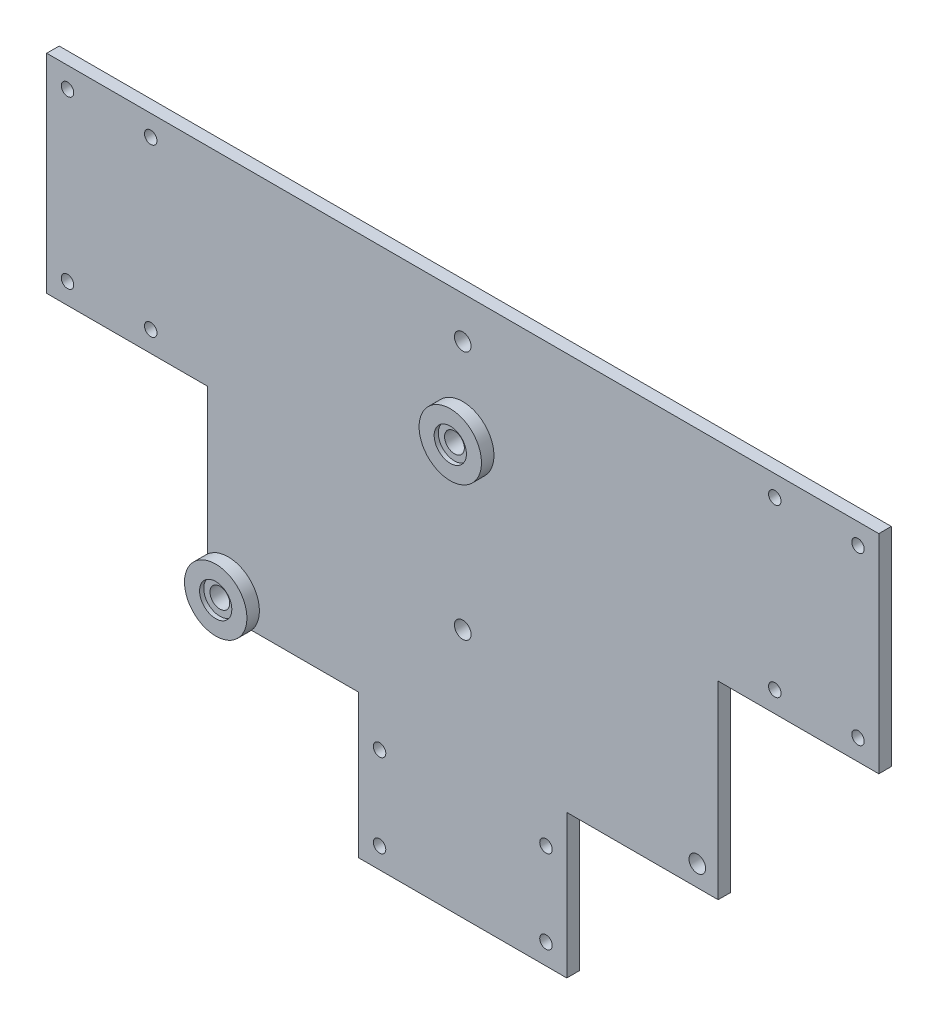
ISO-10303-21;
HEADER;
FILE_DESCRIPTION(('STEP AP214'),'2;1');
FILE_NAME('part.step','',(''),(''),'','','');
FILE_SCHEMA(('AUTOMOTIVE_DESIGN { 1 0 10303 214 1 1 1 1 }'));
ENDSEC;
DATA;
#1=APPLICATION_CONTEXT('core data for automotive mechanical design processes');
#2=APPLICATION_PROTOCOL_DEFINITION('international standard','automotive_design',2000,#1);
#3=PRODUCT_CONTEXT('',#1,'mechanical');
#4=PRODUCT('Part','Part','',(#3));
#5=PRODUCT_RELATED_PRODUCT_CATEGORY('part','',(#4));
#6=PRODUCT_DEFINITION_FORMATION('','',#4);
#7=PRODUCT_DEFINITION_CONTEXT('part definition',#1,'design');
#8=PRODUCT_DEFINITION('design','',#6,#7);
#9=PRODUCT_DEFINITION_SHAPE('','',#8);
#10=(LENGTH_UNIT() NAMED_UNIT(*) SI_UNIT(.MILLI.,.METRE.));
#11=(NAMED_UNIT(*) PLANE_ANGLE_UNIT() SI_UNIT($,.RADIAN.));
#12=(NAMED_UNIT(*) SI_UNIT($,.STERADIAN.) SOLID_ANGLE_UNIT());
#13=UNCERTAINTY_MEASURE_WITH_UNIT(LENGTH_MEASURE(1.E-05),#10,'distance_accuracy_value','');
#14=(GEOMETRIC_REPRESENTATION_CONTEXT(3) GLOBAL_UNCERTAINTY_ASSIGNED_CONTEXT((#13)) GLOBAL_UNIT_ASSIGNED_CONTEXT((#10,
#11,#12)) REPRESENTATION_CONTEXT('',''));
#15=CARTESIAN_POINT('',(0.,0.,0.));
#16=DIRECTION('',(0.,0.,1.));
#17=DIRECTION('',(1.,0.,0.));
#18=AXIS2_PLACEMENT_3D('',#15,#16,#17);
#19=CARTESIAN_POINT('',(100.,50.,3.));
#20=DIRECTION('',(0.,0.,-1.));
#21=DIRECTION('',(-1.,0.,0.));
#22=AXIS2_PLACEMENT_3D('',#19,#20,#21);
#23=PLANE('',#22);
#24=CARTESIAN_POINT('',(0.,20.,3.));
#25=DIRECTION('',(0.,0.,-1.));
#26=DIRECTION('',(-1.,0.,0.));
#27=AXIS2_PLACEMENT_3D('',#24,#25,#26);
#28=CIRCLE('',#27,7.5);
#29=CARTESIAN_POINT('',(-7.50000000000001,20.,3.));
#30=VERTEX_POINT('',#29);
#31=EDGE_CURVE('E145',#30,#30,#28,.T.);
#32=ORIENTED_EDGE('',*,*,#31,.T.);
#33=EDGE_LOOP('',(#32));
#34=FACE_BOUND('',#33,.T.);
#35=CARTESIAN_POINT('',(56.3815572471545,-40.5212085995402,3.));
#36=DIRECTION('',(0.,0.,1.));
#37=DIRECTION('',(-1.,0.,0.));
#38=AXIS2_PLACEMENT_3D('',#35,#36,#37);
#39=CIRCLE('',#38,2.00000000000002);
#40=CARTESIAN_POINT('',(54.3815572471545,-40.5212085995402,3.));
#41=VERTEX_POINT('',#40);
#42=EDGE_CURVE('E157',#41,#41,#39,.T.);
#43=ORIENTED_EDGE('',*,*,#42,.F.);
#44=EDGE_LOOP('',(#43));
#45=FACE_BOUND('',#44,.T.);
#46=CARTESIAN_POINT('',(75.,45.,3.));
#47=DIRECTION('',(0.,0.,1.));
#48=DIRECTION('',(1.,0.,0.));
#49=AXIS2_PLACEMENT_3D('',#46,#47,#48);
#50=CIRCLE('',#49,1.50000000000001);
#51=CARTESIAN_POINT('',(76.5,45.,3.));
#52=VERTEX_POINT('',#51);
#53=EDGE_CURVE('E169',#52,#52,#50,.T.);
#54=ORIENTED_EDGE('',*,*,#53,.F.);
#55=EDGE_LOOP('',(#54));
#56=FACE_BOUND('',#55,.T.);
#57=CARTESIAN_POINT('',(75.,5.,3.));
#58=DIRECTION('',(0.,0.,1.));
#59=DIRECTION('',(-1.,0.,0.));
#60=AXIS2_PLACEMENT_3D('',#57,#58,#59);
#61=CIRCLE('',#60,1.50000000000001);
#62=CARTESIAN_POINT('',(73.5,5.,3.));
#63=VERTEX_POINT('',#62);
#64=EDGE_CURVE('E181',#63,#63,#61,.T.);
#65=ORIENTED_EDGE('',*,*,#64,.F.);
#66=EDGE_LOOP('',(#65));
#67=FACE_BOUND('',#66,.T.);
#68=CARTESIAN_POINT('',(-75.,5.,3.));
#69=DIRECTION('',(0.,0.,1.));
#70=DIRECTION('',(1.,0.,0.));
#71=AXIS2_PLACEMENT_3D('',#68,#69,#70);
#72=CIRCLE('',#71,1.5);
#73=CARTESIAN_POINT('',(-73.5,5.,3.));
#74=VERTEX_POINT('',#73);
#75=EDGE_CURVE('E193',#74,#74,#72,.T.);
#76=ORIENTED_EDGE('',*,*,#75,.F.);
#77=EDGE_LOOP('',(#76));
#78=FACE_BOUND('',#77,.T.);
#79=CARTESIAN_POINT('',(-95.,45.,3.));
#80=DIRECTION('',(0.,0.,1.));
#81=DIRECTION('',(1.,0.,0.));
#82=AXIS2_PLACEMENT_3D('',#79,#80,#81);
#83=CIRCLE('',#82,1.5);
#84=CARTESIAN_POINT('',(-93.5,45.,3.));
#85=VERTEX_POINT('',#84);
#86=EDGE_CURVE('E205',#85,#85,#83,.T.);
#87=ORIENTED_EDGE('',*,*,#86,.F.);
#88=EDGE_LOOP('',(#87));
#89=FACE_BOUND('',#88,.T.);
#90=CARTESIAN_POINT('',(20.,-75.,3.));
#91=DIRECTION('',(0.,0.,1.));
#92=DIRECTION('',(1.,0.,0.));
#93=AXIS2_PLACEMENT_3D('',#90,#91,#92);
#94=CIRCLE('',#93,1.5);
#95=CARTESIAN_POINT('',(21.5,-75.,3.));
#96=VERTEX_POINT('',#95);
#97=EDGE_CURVE('E217',#96,#96,#94,.T.);
#98=ORIENTED_EDGE('',*,*,#97,.F.);
#99=EDGE_LOOP('',(#98));
#100=FACE_BOUND('',#99,.T.);
#101=CARTESIAN_POINT('',(-20.,-55.,3.));
#102=DIRECTION('',(0.,0.,1.));
#103=DIRECTION('',(1.,0.,0.));
#104=AXIS2_PLACEMENT_3D('',#101,#102,#103);
#105=CIRCLE('',#104,1.5);
#106=CARTESIAN_POINT('',(-18.5,-55.,3.));
#107=VERTEX_POINT('',#106);
#108=EDGE_CURVE('E229',#107,#107,#105,.T.);
#109=ORIENTED_EDGE('',*,*,#108,.F.);
#110=EDGE_LOOP('',(#109));
#111=FACE_BOUND('',#110,.T.);
#112=CARTESIAN_POINT('',(0.,-20.,3.));
#113=DIRECTION('',(0.,0.,1.));
#114=DIRECTION('',(1.,0.,0.));
#115=AXIS2_PLACEMENT_3D('',#112,#113,#114);
#116=CIRCLE('',#115,2.);
#117=CARTESIAN_POINT('',(2.,-20.,3.));
#118=VERTEX_POINT('',#117);
#119=EDGE_CURVE('E241',#118,#118,#116,.T.);
#120=ORIENTED_EDGE('',*,*,#119,.F.);
#121=EDGE_LOOP('',(#120));
#122=FACE_BOUND('',#121,.T.);
#123=DIRECTION('',(0.,-1.,0.));
#124=VECTOR('',#123,1.);
#125=CARTESIAN_POINT('',(-61.3815572471545,0.,3.));
#126=LINE('',#125,#124);
#127=CARTESIAN_POINT('',(-61.3815572471545,0.,3.));
#128=VERTEX_POINT('',#127);
#129=CARTESIAN_POINT('',(-61.3815572471545,-34.9310386557907,3.));
#130=VERTEX_POINT('',#129);
#131=EDGE_CURVE('E254',#128,#130,#126,.T.);
#132=ORIENTED_EDGE('',*,*,#131,.T.);
#133=CARTESIAN_POINT('',(-56.3815572471545,-40.5212085995402,3.));
#134=DIRECTION('',(0.,0.,-1.));
#135=DIRECTION('',(-1.,0.,0.));
#136=AXIS2_PLACEMENT_3D('',#133,#134,#135);
#137=CIRCLE('',#136,7.50000000000001);
#138=CARTESIAN_POINT('',(-50.791387303405,-45.5212085995402,3.));
#139=VERTEX_POINT('',#138);
#140=EDGE_CURVE('E148',#130,#139,#137,.T.);
#141=ORIENTED_EDGE('',*,*,#140,.T.);
#142=DIRECTION('',(1.,0.,0.));
#143=VECTOR('',#142,1.);
#144=CARTESIAN_POINT('',(-61.3815572471545,-45.5212085995402,3.));
#145=LINE('',#144,#143);
#146=CARTESIAN_POINT('',(-25.,-45.5212085995402,3.));
#147=VERTEX_POINT('',#146);
#148=EDGE_CURVE('E140',#139,#147,#145,.T.);
#149=ORIENTED_EDGE('',*,*,#148,.T.);
#150=DIRECTION('',(0.,-1.,0.));
#151=VECTOR('',#150,1.);
#152=CARTESIAN_POINT('',(-25.,-80.,3.));
#153=LINE('',#152,#151);
#154=CARTESIAN_POINT('',(-25.,-80.,3.));
#155=VERTEX_POINT('',#154);
#156=EDGE_CURVE('E257',#147,#155,#153,.T.);
#157=ORIENTED_EDGE('',*,*,#156,.T.);
#158=DIRECTION('',(1.,0.,0.));
#159=VECTOR('',#158,1.);
#160=CARTESIAN_POINT('',(25.,-80.,3.));
#161=LINE('',#160,#159);
#162=CARTESIAN_POINT('',(25.,-80.,3.));
#163=VERTEX_POINT('',#162);
#164=EDGE_CURVE('E259',#155,#163,#161,.T.);
#165=ORIENTED_EDGE('',*,*,#164,.T.);
#166=DIRECTION('',(0.,1.,0.));
#167=VECTOR('',#166,1.);
#168=CARTESIAN_POINT('',(25.,-80.,3.));
#169=LINE('',#168,#167);
#170=CARTESIAN_POINT('',(25.,-45.5212085995402,3.));
#171=VERTEX_POINT('',#170);
#172=EDGE_CURVE('E261',#163,#171,#169,.T.);
#173=ORIENTED_EDGE('',*,*,#172,.T.);
#174=DIRECTION('',(1.,0.,0.));
#175=VECTOR('',#174,1.);
#176=CARTESIAN_POINT('',(61.3815572471545,-45.5212085995402,3.));
#177=LINE('',#176,#175);
#178=CARTESIAN_POINT('',(61.3815572471545,-45.5212085995402,3.));
#179=VERTEX_POINT('',#178);
#180=EDGE_CURVE('E263',#171,#179,#177,.T.);
#181=ORIENTED_EDGE('',*,*,#180,.T.);
#182=DIRECTION('',(0.,1.,0.));
#183=VECTOR('',#182,1.);
#184=CARTESIAN_POINT('',(61.3815572471545,0.,3.));
#185=LINE('',#184,#183);
#186=CARTESIAN_POINT('',(61.3815572471545,0.,3.));
#187=VERTEX_POINT('',#186);
#188=EDGE_CURVE('E265',#179,#187,#185,.T.);
#189=ORIENTED_EDGE('',*,*,#188,.T.);
#190=DIRECTION('',(1.,0.,0.));
#191=VECTOR('',#190,1.);
#192=CARTESIAN_POINT('',(100.,0.,3.));
#193=LINE('',#192,#191);
#194=CARTESIAN_POINT('',(100.,0.,3.));
#195=VERTEX_POINT('',#194);
#196=EDGE_CURVE('E267',#187,#195,#193,.T.);
#197=ORIENTED_EDGE('',*,*,#196,.T.);
#198=DIRECTION('',(0.,1.,0.));
#199=VECTOR('',#198,1.);
#200=CARTESIAN_POINT('',(100.,50.,3.));
#201=LINE('',#200,#199);
#202=CARTESIAN_POINT('',(100.,50.,3.));
#203=VERTEX_POINT('',#202);
#204=EDGE_CURVE('E269',#195,#203,#201,.T.);
#205=ORIENTED_EDGE('',*,*,#204,.T.);
#206=DIRECTION('',(-1.,0.,0.));
#207=VECTOR('',#206,1.);
#208=CARTESIAN_POINT('',(0.,50.,3.));
#209=LINE('',#208,#207);
#210=CARTESIAN_POINT('',(-100.,50.,3.));
#211=VERTEX_POINT('',#210);
#212=EDGE_CURVE('E247',#203,#211,#209,.T.);
#213=ORIENTED_EDGE('',*,*,#212,.T.);
#214=DIRECTION('',(0.,-1.,0.));
#215=VECTOR('',#214,1.);
#216=CARTESIAN_POINT('',(-100.,50.,3.));
#217=LINE('',#216,#215);
#218=CARTESIAN_POINT('',(-100.,0.,3.));
#219=VERTEX_POINT('',#218);
#220=EDGE_CURVE('E249',#211,#219,#217,.T.);
#221=ORIENTED_EDGE('',*,*,#220,.T.);
#222=DIRECTION('',(1.,0.,0.));
#223=VECTOR('',#222,1.);
#224=CARTESIAN_POINT('',(-100.,0.,3.));
#225=LINE('',#224,#223);
#226=EDGE_CURVE('E252',#219,#128,#225,.T.);
#227=ORIENTED_EDGE('',*,*,#226,.T.);
#228=EDGE_LOOP('',(#132,#141,#149,#157,#165,#173,#181,#189,#197,#205,#213,#221,#227));
#229=FACE_BOUND('',#228,.T.);
#230=CARTESIAN_POINT('',(0.,40.,3.));
#231=DIRECTION('',(0.,0.,1.));
#232=DIRECTION('',(1.,0.,0.));
#233=AXIS2_PLACEMENT_3D('',#230,#231,#232);
#234=CIRCLE('',#233,2.);
#235=CARTESIAN_POINT('',(1.99999999999999,40.,3.));
#236=VERTEX_POINT('',#235);
#237=EDGE_CURVE('E235',#236,#236,#234,.T.);
#238=ORIENTED_EDGE('',*,*,#237,.F.);
#239=EDGE_LOOP('',(#238));
#240=FACE_BOUND('',#239,.T.);
#241=CARTESIAN_POINT('',(20.,-55.,3.));
#242=DIRECTION('',(0.,0.,1.));
#243=DIRECTION('',(-1.,0.,0.));
#244=AXIS2_PLACEMENT_3D('',#241,#242,#243);
#245=CIRCLE('',#244,1.5);
#246=CARTESIAN_POINT('',(18.5,-55.,3.));
#247=VERTEX_POINT('',#246);
#248=EDGE_CURVE('E223',#247,#247,#245,.T.);
#249=ORIENTED_EDGE('',*,*,#248,.F.);
#250=EDGE_LOOP('',(#249));
#251=FACE_BOUND('',#250,.T.);
#252=CARTESIAN_POINT('',(-20.,-75.,3.));
#253=DIRECTION('',(0.,0.,1.));
#254=DIRECTION('',(-1.,0.,0.));
#255=AXIS2_PLACEMENT_3D('',#252,#253,#254);
#256=CIRCLE('',#255,1.5);
#257=CARTESIAN_POINT('',(-21.5,-75.,3.));
#258=VERTEX_POINT('',#257);
#259=EDGE_CURVE('E211',#258,#258,#256,.T.);
#260=ORIENTED_EDGE('',*,*,#259,.F.);
#261=EDGE_LOOP('',(#260));
#262=FACE_BOUND('',#261,.T.);
#263=CARTESIAN_POINT('',(-75.,45.,3.));
#264=DIRECTION('',(0.,0.,1.));
#265=DIRECTION('',(-1.,0.,0.));
#266=AXIS2_PLACEMENT_3D('',#263,#264,#265);
#267=CIRCLE('',#266,1.5);
#268=CARTESIAN_POINT('',(-76.5,45.,3.));
#269=VERTEX_POINT('',#268);
#270=EDGE_CURVE('E199',#269,#269,#267,.T.);
#271=ORIENTED_EDGE('',*,*,#270,.F.);
#272=EDGE_LOOP('',(#271));
#273=FACE_BOUND('',#272,.T.);
#274=CARTESIAN_POINT('',(-95.,5.,3.));
#275=DIRECTION('',(0.,0.,1.));
#276=DIRECTION('',(-1.,0.,0.));
#277=AXIS2_PLACEMENT_3D('',#274,#275,#276);
#278=CIRCLE('',#277,1.5);
#279=CARTESIAN_POINT('',(-96.5,5.,3.));
#280=VERTEX_POINT('',#279);
#281=EDGE_CURVE('E187',#280,#280,#278,.T.);
#282=ORIENTED_EDGE('',*,*,#281,.F.);
#283=EDGE_LOOP('',(#282));
#284=FACE_BOUND('',#283,.T.);
#285=CARTESIAN_POINT('',(95.,5.,3.));
#286=DIRECTION('',(0.,0.,1.));
#287=DIRECTION('',(1.,0.,0.));
#288=AXIS2_PLACEMENT_3D('',#285,#286,#287);
#289=CIRCLE('',#288,1.49999999999998);
#290=CARTESIAN_POINT('',(96.5,5.,3.));
#291=VERTEX_POINT('',#290);
#292=EDGE_CURVE('E175',#291,#291,#289,.T.);
#293=ORIENTED_EDGE('',*,*,#292,.F.);
#294=EDGE_LOOP('',(#293));
#295=FACE_BOUND('',#294,.T.);
#296=CARTESIAN_POINT('',(95.,45.,3.));
#297=DIRECTION('',(0.,0.,1.));
#298=DIRECTION('',(-1.,0.,0.));
#299=AXIS2_PLACEMENT_3D('',#296,#297,#298);
#300=CIRCLE('',#299,1.49999999999998);
#301=CARTESIAN_POINT('',(93.5,45.,3.));
#302=VERTEX_POINT('',#301);
#303=EDGE_CURVE('E163',#302,#302,#300,.T.);
#304=ORIENTED_EDGE('',*,*,#303,.F.);
#305=EDGE_LOOP('',(#304));
#306=FACE_BOUND('',#305,.T.);
#307=ADVANCED_FACE('F31',(#34,#45,#56,#67,#78,#89,#100,#111,#122,#229,#240,#251,#262,#273,#284,
#295,#306),#23,.F.);
#308=CARTESIAN_POINT('',(100.,50.,0.));
#309=DIRECTION('',(0.,0.,-1.));
#310=DIRECTION('',(-1.,0.,0.));
#311=AXIS2_PLACEMENT_3D('',#308,#309,#310);
#312=PLANE('',#311);
#313=DIRECTION('',(1.,0.,0.));
#314=VECTOR('',#313,1.);
#315=CARTESIAN_POINT('',(-61.3815572471545,-45.5212085995402,0.));
#316=LINE('',#315,#314);
#317=CARTESIAN_POINT('',(-50.791387303405,-45.5212085995402,0.));
#318=VERTEX_POINT('',#317);
#319=CARTESIAN_POINT('',(-25.,-45.5212085995402,0.));
#320=VERTEX_POINT('',#319);
#321=EDGE_CURVE('E126',#318,#320,#316,.T.);
#322=ORIENTED_EDGE('',*,*,#321,.F.);
#323=CARTESIAN_POINT('',(-56.3815572471545,-40.5212085995402,0.));
#324=DIRECTION('',(0.,0.,-1.));
#325=DIRECTION('',(-1.,0.,0.));
#326=AXIS2_PLACEMENT_3D('',#323,#324,#325);
#327=CIRCLE('',#326,7.50000000000001);
#328=CARTESIAN_POINT('',(-61.3815572471545,-34.9310386557907,0.));
#329=VERTEX_POINT('',#328);
#330=EDGE_CURVE('E130',#318,#329,#327,.T.);
#331=ORIENTED_EDGE('',*,*,#330,.T.);
#332=DIRECTION('',(0.,-1.,0.));
#333=VECTOR('',#332,1.);
#334=CARTESIAN_POINT('',(-61.3815572471545,0.,0.));
#335=LINE('',#334,#333);
#336=CARTESIAN_POINT('',(-61.3815572471545,0.,0.));
#337=VERTEX_POINT('',#336);
#338=EDGE_CURVE('E51',#337,#329,#335,.T.);
#339=ORIENTED_EDGE('',*,*,#338,.F.);
#340=DIRECTION('',(1.,0.,0.));
#341=VECTOR('',#340,1.);
#342=CARTESIAN_POINT('',(-100.,0.,0.));
#343=LINE('',#342,#341);
#344=CARTESIAN_POINT('',(-100.,0.,0.));
#345=VERTEX_POINT('',#344);
#346=EDGE_CURVE('E275',#345,#337,#343,.T.);
#347=ORIENTED_EDGE('',*,*,#346,.F.);
#348=DIRECTION('',(0.,-1.,0.));
#349=VECTOR('',#348,1.);
#350=CARTESIAN_POINT('',(-100.,50.,0.));
#351=LINE('',#350,#349);
#352=CARTESIAN_POINT('',(-100.,50.,0.));
#353=VERTEX_POINT('',#352);
#354=EDGE_CURVE('E273',#353,#345,#351,.T.);
#355=ORIENTED_EDGE('',*,*,#354,.F.);
#356=DIRECTION('',(-1.,0.,0.));
#357=VECTOR('',#356,1.);
#358=CARTESIAN_POINT('',(0.,50.,0.));
#359=LINE('',#358,#357);
#360=CARTESIAN_POINT('',(100.,50.,0.));
#361=VERTEX_POINT('',#360);
#362=EDGE_CURVE('E244',#361,#353,#359,.T.);
#363=ORIENTED_EDGE('',*,*,#362,.F.);
#364=DIRECTION('',(0.,1.,0.));
#365=VECTOR('',#364,1.);
#366=CARTESIAN_POINT('',(100.,50.,0.));
#367=LINE('',#366,#365);
#368=CARTESIAN_POINT('',(100.,0.,0.));
#369=VERTEX_POINT('',#368);
#370=EDGE_CURVE('E250',#369,#361,#367,.T.);
#371=ORIENTED_EDGE('',*,*,#370,.F.);
#372=DIRECTION('',(1.,0.,0.));
#373=VECTOR('',#372,1.);
#374=CARTESIAN_POINT('',(100.,0.,0.));
#375=LINE('',#374,#373);
#376=CARTESIAN_POINT('',(61.3815572471545,0.,0.));
#377=VERTEX_POINT('',#376);
#378=EDGE_CURVE('E287',#377,#369,#375,.T.);
#379=ORIENTED_EDGE('',*,*,#378,.F.);
#380=DIRECTION('',(0.,1.,0.));
#381=VECTOR('',#380,1.);
#382=CARTESIAN_POINT('',(61.3815572471545,0.,0.));
#383=LINE('',#382,#381);
#384=CARTESIAN_POINT('',(61.3815572471545,-45.5212085995402,0.));
#385=VERTEX_POINT('',#384);
#386=EDGE_CURVE('E285',#385,#377,#383,.T.);
#387=ORIENTED_EDGE('',*,*,#386,.F.);
#388=DIRECTION('',(1.,0.,0.));
#389=VECTOR('',#388,1.);
#390=CARTESIAN_POINT('',(61.3815572471545,-45.5212085995402,0.));
#391=LINE('',#390,#389);
#392=CARTESIAN_POINT('',(25.,-45.5212085995402,0.));
#393=VERTEX_POINT('',#392);
#394=EDGE_CURVE('E283',#393,#385,#391,.T.);
#395=ORIENTED_EDGE('',*,*,#394,.F.);
#396=DIRECTION('',(0.,1.,0.));
#397=VECTOR('',#396,1.);
#398=CARTESIAN_POINT('',(25.,-80.,0.));
#399=LINE('',#398,#397);
#400=CARTESIAN_POINT('',(25.,-80.,0.));
#401=VERTEX_POINT('',#400);
#402=EDGE_CURVE('E281',#401,#393,#399,.T.);
#403=ORIENTED_EDGE('',*,*,#402,.F.);
#404=DIRECTION('',(1.,0.,0.));
#405=VECTOR('',#404,1.);
#406=CARTESIAN_POINT('',(25.,-80.,0.));
#407=LINE('',#406,#405);
#408=CARTESIAN_POINT('',(-25.,-80.,0.));
#409=VERTEX_POINT('',#408);
#410=EDGE_CURVE('E279',#409,#401,#407,.T.);
#411=ORIENTED_EDGE('',*,*,#410,.F.);
#412=DIRECTION('',(0.,-1.,0.));
#413=VECTOR('',#412,1.);
#414=CARTESIAN_POINT('',(-25.,-80.,0.));
#415=LINE('',#414,#413);
#416=EDGE_CURVE('E132',#320,#409,#415,.T.);
#417=ORIENTED_EDGE('',*,*,#416,.F.);
#418=EDGE_LOOP('',(#322,#331,#339,#347,#355,#363,#371,#379,#387,#395,#403,#411,#417));
#419=FACE_BOUND('',#418,.T.);
#420=CARTESIAN_POINT('',(56.3815572471545,-40.5212085995402,0.));
#421=DIRECTION('',(0.,0.,1.));
#422=DIRECTION('',(-1.,0.,0.));
#423=AXIS2_PLACEMENT_3D('',#420,#421,#422);
#424=CIRCLE('',#423,2.00000000000002);
#425=CARTESIAN_POINT('',(54.3815572471545,-40.5212085995402,0.));
#426=VERTEX_POINT('',#425);
#427=EDGE_CURVE('E156',#426,#426,#424,.T.);
#428=ORIENTED_EDGE('',*,*,#427,.T.);
#429=EDGE_LOOP('',(#428));
#430=FACE_BOUND('',#429,.T.);
#431=CARTESIAN_POINT('',(75.,45.,0.));
#432=DIRECTION('',(0.,0.,1.));
#433=DIRECTION('',(1.,0.,0.));
#434=AXIS2_PLACEMENT_3D('',#431,#432,#433);
#435=CIRCLE('',#434,1.50000000000001);
#436=CARTESIAN_POINT('',(76.5,45.,0.));
#437=VERTEX_POINT('',#436);
#438=EDGE_CURVE('E166',#437,#437,#435,.T.);
#439=ORIENTED_EDGE('',*,*,#438,.T.);
#440=EDGE_LOOP('',(#439));
#441=FACE_BOUND('',#440,.T.);
#442=CARTESIAN_POINT('',(75.,5.,0.));
#443=DIRECTION('',(0.,0.,1.));
#444=DIRECTION('',(-1.,0.,0.));
#445=AXIS2_PLACEMENT_3D('',#442,#443,#444);
#446=CIRCLE('',#445,1.50000000000001);
#447=CARTESIAN_POINT('',(73.5,5.,0.));
#448=VERTEX_POINT('',#447);
#449=EDGE_CURVE('E178',#448,#448,#446,.T.);
#450=ORIENTED_EDGE('',*,*,#449,.T.);
#451=EDGE_LOOP('',(#450));
#452=FACE_BOUND('',#451,.T.);
#453=CARTESIAN_POINT('',(-75.,5.,0.));
#454=DIRECTION('',(0.,0.,1.));
#455=DIRECTION('',(1.,0.,0.));
#456=AXIS2_PLACEMENT_3D('',#453,#454,#455);
#457=CIRCLE('',#456,1.5);
#458=CARTESIAN_POINT('',(-73.5,5.,0.));
#459=VERTEX_POINT('',#458);
#460=EDGE_CURVE('E190',#459,#459,#457,.T.);
#461=ORIENTED_EDGE('',*,*,#460,.T.);
#462=EDGE_LOOP('',(#461));
#463=FACE_BOUND('',#462,.T.);
#464=CARTESIAN_POINT('',(-95.,45.,0.));
#465=DIRECTION('',(0.,0.,1.));
#466=DIRECTION('',(1.,0.,0.));
#467=AXIS2_PLACEMENT_3D('',#464,#465,#466);
#468=CIRCLE('',#467,1.5);
#469=CARTESIAN_POINT('',(-93.5,45.,0.));
#470=VERTEX_POINT('',#469);
#471=EDGE_CURVE('E202',#470,#470,#468,.T.);
#472=ORIENTED_EDGE('',*,*,#471,.T.);
#473=EDGE_LOOP('',(#472));
#474=FACE_BOUND('',#473,.T.);
#475=CARTESIAN_POINT('',(20.,-75.,0.));
#476=DIRECTION('',(0.,0.,1.));
#477=DIRECTION('',(1.,0.,0.));
#478=AXIS2_PLACEMENT_3D('',#475,#476,#477);
#479=CIRCLE('',#478,1.5);
#480=CARTESIAN_POINT('',(21.5,-75.,0.));
#481=VERTEX_POINT('',#480);
#482=EDGE_CURVE('E214',#481,#481,#479,.T.);
#483=ORIENTED_EDGE('',*,*,#482,.T.);
#484=EDGE_LOOP('',(#483));
#485=FACE_BOUND('',#484,.T.);
#486=CARTESIAN_POINT('',(-20.,-55.,0.));
#487=DIRECTION('',(0.,0.,1.));
#488=DIRECTION('',(1.,0.,0.));
#489=AXIS2_PLACEMENT_3D('',#486,#487,#488);
#490=CIRCLE('',#489,1.5);
#491=CARTESIAN_POINT('',(-18.5,-55.,0.));
#492=VERTEX_POINT('',#491);
#493=EDGE_CURVE('E226',#492,#492,#490,.T.);
#494=ORIENTED_EDGE('',*,*,#493,.T.);
#495=EDGE_LOOP('',(#494));
#496=FACE_BOUND('',#495,.T.);
#497=CARTESIAN_POINT('',(0.,-20.,0.));
#498=DIRECTION('',(0.,0.,1.));
#499=DIRECTION('',(1.,0.,0.));
#500=AXIS2_PLACEMENT_3D('',#497,#498,#499);
#501=CIRCLE('',#500,2.);
#502=CARTESIAN_POINT('',(2.,-20.,0.));
#503=VERTEX_POINT('',#502);
#504=EDGE_CURVE('E238',#503,#503,#501,.T.);
#505=ORIENTED_EDGE('',*,*,#504,.T.);
#506=EDGE_LOOP('',(#505));
#507=FACE_BOUND('',#506,.T.);
#508=CARTESIAN_POINT('',(0.,40.,0.));
#509=DIRECTION('',(0.,0.,1.));
#510=DIRECTION('',(1.,0.,0.));
#511=AXIS2_PLACEMENT_3D('',#508,#509,#510);
#512=CIRCLE('',#511,2.);
#513=CARTESIAN_POINT('',(1.99999999999999,40.,0.));
#514=VERTEX_POINT('',#513);
#515=EDGE_CURVE('E232',#514,#514,#512,.T.);
#516=ORIENTED_EDGE('',*,*,#515,.T.);
#517=EDGE_LOOP('',(#516));
#518=FACE_BOUND('',#517,.T.);
#519=CARTESIAN_POINT('',(20.,-55.,0.));
#520=DIRECTION('',(0.,0.,1.));
#521=DIRECTION('',(-1.,0.,0.));
#522=AXIS2_PLACEMENT_3D('',#519,#520,#521);
#523=CIRCLE('',#522,1.5);
#524=CARTESIAN_POINT('',(18.5,-55.,0.));
#525=VERTEX_POINT('',#524);
#526=EDGE_CURVE('E220',#525,#525,#523,.T.);
#527=ORIENTED_EDGE('',*,*,#526,.T.);
#528=EDGE_LOOP('',(#527));
#529=FACE_BOUND('',#528,.T.);
#530=CARTESIAN_POINT('',(-20.,-75.,0.));
#531=DIRECTION('',(0.,0.,1.));
#532=DIRECTION('',(-1.,0.,0.));
#533=AXIS2_PLACEMENT_3D('',#530,#531,#532);
#534=CIRCLE('',#533,1.5);
#535=CARTESIAN_POINT('',(-21.5,-75.,0.));
#536=VERTEX_POINT('',#535);
#537=EDGE_CURVE('E208',#536,#536,#534,.T.);
#538=ORIENTED_EDGE('',*,*,#537,.T.);
#539=EDGE_LOOP('',(#538));
#540=FACE_BOUND('',#539,.T.);
#541=CARTESIAN_POINT('',(-75.,45.,0.));
#542=DIRECTION('',(0.,0.,1.));
#543=DIRECTION('',(-1.,0.,0.));
#544=AXIS2_PLACEMENT_3D('',#541,#542,#543);
#545=CIRCLE('',#544,1.5);
#546=CARTESIAN_POINT('',(-76.5,45.,0.));
#547=VERTEX_POINT('',#546);
#548=EDGE_CURVE('E196',#547,#547,#545,.T.);
#549=ORIENTED_EDGE('',*,*,#548,.T.);
#550=EDGE_LOOP('',(#549));
#551=FACE_BOUND('',#550,.T.);
#552=CARTESIAN_POINT('',(-95.,5.,0.));
#553=DIRECTION('',(0.,0.,1.));
#554=DIRECTION('',(-1.,0.,0.));
#555=AXIS2_PLACEMENT_3D('',#552,#553,#554);
#556=CIRCLE('',#555,1.5);
#557=CARTESIAN_POINT('',(-96.5,5.,0.));
#558=VERTEX_POINT('',#557);
#559=EDGE_CURVE('E184',#558,#558,#556,.T.);
#560=ORIENTED_EDGE('',*,*,#559,.T.);
#561=EDGE_LOOP('',(#560));
#562=FACE_BOUND('',#561,.T.);
#563=CARTESIAN_POINT('',(95.,5.,0.));
#564=DIRECTION('',(0.,0.,1.));
#565=DIRECTION('',(1.,0.,0.));
#566=AXIS2_PLACEMENT_3D('',#563,#564,#565);
#567=CIRCLE('',#566,1.49999999999998);
#568=CARTESIAN_POINT('',(96.5,5.,0.));
#569=VERTEX_POINT('',#568);
#570=EDGE_CURVE('E172',#569,#569,#567,.T.);
#571=ORIENTED_EDGE('',*,*,#570,.T.);
#572=EDGE_LOOP('',(#571));
#573=FACE_BOUND('',#572,.T.);
#574=CARTESIAN_POINT('',(95.,45.,0.));
#575=DIRECTION('',(0.,0.,1.));
#576=DIRECTION('',(-1.,0.,0.));
#577=AXIS2_PLACEMENT_3D('',#574,#575,#576);
#578=CIRCLE('',#577,1.49999999999998);
#579=CARTESIAN_POINT('',(93.5,45.,0.));
#580=VERTEX_POINT('',#579);
#581=EDGE_CURVE('E160',#580,#580,#578,.T.);
#582=ORIENTED_EDGE('',*,*,#581,.T.);
#583=EDGE_LOOP('',(#582));
#584=FACE_BOUND('',#583,.T.);
#585=ADVANCED_FACE('F127',(#419,#430,#441,#452,#463,#474,#485,#496,#507,#518,#529,#540,#551,
#562,#573,#584),#312,.T.);
#586=CARTESIAN_POINT('',(0.,50.,3.));
#587=DIRECTION('',(0.,-1.,0.));
#588=DIRECTION('',(0.,0.,-1.));
#589=AXIS2_PLACEMENT_3D('',#586,#587,#588);
#590=PLANE('',#589);
#591=ORIENTED_EDGE('',*,*,#362,.T.);
#592=DIRECTION('',(0.,0.,-1.));
#593=VECTOR('',#592,1.);
#594=CARTESIAN_POINT('',(-100.,50.,3.));
#595=LINE('',#594,#593);
#596=EDGE_CURVE('E39',#211,#353,#595,.T.);
#597=ORIENTED_EDGE('',*,*,#596,.F.);
#598=ORIENTED_EDGE('',*,*,#212,.F.);
#599=DIRECTION('',(0.,0.,-1.));
#600=VECTOR('',#599,1.);
#601=CARTESIAN_POINT('',(100.,50.,3.));
#602=LINE('',#601,#600);
#603=EDGE_CURVE('E271',#203,#361,#602,.T.);
#604=ORIENTED_EDGE('',*,*,#603,.T.);
#605=EDGE_LOOP('',(#591,#597,#598,#604));
#606=FACE_BOUND('',#605,.T.);
#607=ADVANCED_FACE('F33',(#606),#590,.F.);
#608=CARTESIAN_POINT('',(-100.,50.,3.));
#609=DIRECTION('',(1.,0.,0.));
#610=DIRECTION('',(0.,0.,-1.));
#611=AXIS2_PLACEMENT_3D('',#608,#609,#610);
#612=PLANE('',#611);
#613=ORIENTED_EDGE('',*,*,#354,.T.);
#614=DIRECTION('',(0.,0.,-1.));
#615=VECTOR('',#614,1.);
#616=CARTESIAN_POINT('',(-100.,0.,3.));
#617=LINE('',#616,#615);
#618=EDGE_CURVE('E315',#219,#345,#617,.T.);
#619=ORIENTED_EDGE('',*,*,#618,.F.);
#620=ORIENTED_EDGE('',*,*,#220,.F.);
#621=ORIENTED_EDGE('',*,*,#596,.T.);
#622=EDGE_LOOP('',(#613,#619,#620,#621));
#623=FACE_BOUND('',#622,.T.);
#624=ADVANCED_FACE('F322',(#623),#612,.F.);
#625=CARTESIAN_POINT('',(-100.,0.,3.));
#626=DIRECTION('',(0.,1.,0.));
#627=DIRECTION('',(0.,0.,1.));
#628=AXIS2_PLACEMENT_3D('',#625,#626,#627);
#629=PLANE('',#628);
#630=ORIENTED_EDGE('',*,*,#346,.T.);
#631=DIRECTION('',(0.,0.,-1.));
#632=VECTOR('',#631,1.);
#633=CARTESIAN_POINT('',(-61.3815572471545,0.,3.));
#634=LINE('',#633,#632);
#635=EDGE_CURVE('E313',#128,#337,#634,.T.);
#636=ORIENTED_EDGE('',*,*,#635,.F.);
#637=ORIENTED_EDGE('',*,*,#226,.F.);
#638=ORIENTED_EDGE('',*,*,#618,.T.);
#639=EDGE_LOOP('',(#630,#636,#637,#638));
#640=FACE_BOUND('',#639,.T.);
#641=ADVANCED_FACE('F330',(#640),#629,.F.);
#642=CARTESIAN_POINT('',(-61.3815572471545,0.,3.));
#643=DIRECTION('',(1.,0.,0.));
#644=DIRECTION('',(0.,0.,-1.));
#645=AXIS2_PLACEMENT_3D('',#642,#643,#644);
#646=PLANE('',#645);
#647=ORIENTED_EDGE('',*,*,#338,.T.);
#648=DIRECTION('',(0.,0.,-1.));
#649=VECTOR('',#648,1.);
#650=CARTESIAN_POINT('',(-61.3815572471545,-34.9310386557907,6.));
#651=LINE('',#650,#649);
#652=EDGE_CURVE('E46',#329,#130,#651,.F.);
#653=ORIENTED_EDGE('',*,*,#652,.T.);
#654=ORIENTED_EDGE('',*,*,#131,.F.);
#655=ORIENTED_EDGE('',*,*,#635,.T.);
#656=EDGE_LOOP('',(#647,#653,#654,#655));
#657=FACE_BOUND('',#656,.T.);
#658=ADVANCED_FACE('F332',(#657),#646,.F.);
#659=CARTESIAN_POINT('',(-61.3815572471545,-45.5212085995402,3.));
#660=DIRECTION('',(0.,1.,0.));
#661=DIRECTION('',(0.,0.,1.));
#662=AXIS2_PLACEMENT_3D('',#659,#660,#661);
#663=PLANE('',#662);
#664=ORIENTED_EDGE('',*,*,#148,.F.);
#665=DIRECTION('',(0.,0.,-1.));
#666=VECTOR('',#665,1.);
#667=CARTESIAN_POINT('',(-50.791387303405,-45.5212085995402,6.));
#668=LINE('',#667,#666);
#669=EDGE_CURVE('E11',#139,#318,#668,.T.);
#670=ORIENTED_EDGE('',*,*,#669,.T.);
#671=ORIENTED_EDGE('',*,*,#321,.T.);
#672=DIRECTION('',(0.,0.,-1.));
#673=VECTOR('',#672,1.);
#674=CARTESIAN_POINT('',(-25.,-45.5212085995402,3.));
#675=LINE('',#674,#673);
#676=EDGE_CURVE('E311',#147,#320,#675,.T.);
#677=ORIENTED_EDGE('',*,*,#676,.F.);
#678=EDGE_LOOP('',(#664,#670,#671,#677));
#679=FACE_BOUND('',#678,.T.);
#680=ADVANCED_FACE('F139',(#679),#663,.F.);
#681=CARTESIAN_POINT('',(-25.,-80.,3.));
#682=DIRECTION('',(1.,0.,0.));
#683=DIRECTION('',(0.,1.,0.));
#684=AXIS2_PLACEMENT_3D('',#681,#682,#683);
#685=PLANE('',#684);
#686=ORIENTED_EDGE('',*,*,#416,.T.);
#687=DIRECTION('',(0.,0.,-1.));
#688=VECTOR('',#687,1.);
#689=CARTESIAN_POINT('',(-25.,-80.,3.));
#690=LINE('',#689,#688);
#691=EDGE_CURVE('E308',#155,#409,#690,.T.);
#692=ORIENTED_EDGE('',*,*,#691,.F.);
#693=ORIENTED_EDGE('',*,*,#156,.F.);
#694=ORIENTED_EDGE('',*,*,#676,.T.);
#695=EDGE_LOOP('',(#686,#692,#693,#694));
#696=FACE_BOUND('',#695,.T.);
#697=ADVANCED_FACE('F366',(#696),#685,.F.);
#698=CARTESIAN_POINT('',(25.,-80.,3.));
#699=DIRECTION('',(0.,1.,0.));
#700=DIRECTION('',(0.,0.,1.));
#701=AXIS2_PLACEMENT_3D('',#698,#699,#700);
#702=PLANE('',#701);
#703=ORIENTED_EDGE('',*,*,#410,.T.);
#704=DIRECTION('',(0.,0.,-1.));
#705=VECTOR('',#704,1.);
#706=CARTESIAN_POINT('',(25.,-80.,3.));
#707=LINE('',#706,#705);
#708=EDGE_CURVE('E305',#163,#401,#707,.T.);
#709=ORIENTED_EDGE('',*,*,#708,.F.);
#710=ORIENTED_EDGE('',*,*,#164,.F.);
#711=ORIENTED_EDGE('',*,*,#691,.T.);
#712=EDGE_LOOP('',(#703,#709,#710,#711));
#713=FACE_BOUND('',#712,.T.);
#714=ADVANCED_FACE('F362',(#713),#702,.F.);
#715=CARTESIAN_POINT('',(25.,-80.,3.));
#716=DIRECTION('',(-1.,0.,0.));
#717=DIRECTION('',(0.,-1.,0.));
#718=AXIS2_PLACEMENT_3D('',#715,#716,#717);
#719=PLANE('',#718);
#720=ORIENTED_EDGE('',*,*,#402,.T.);
#721=DIRECTION('',(0.,0.,-1.));
#722=VECTOR('',#721,1.);
#723=CARTESIAN_POINT('',(25.,-45.5212085995402,3.));
#724=LINE('',#723,#722);
#725=EDGE_CURVE('E302',#171,#393,#724,.T.);
#726=ORIENTED_EDGE('',*,*,#725,.F.);
#727=ORIENTED_EDGE('',*,*,#172,.F.);
#728=ORIENTED_EDGE('',*,*,#708,.T.);
#729=EDGE_LOOP('',(#720,#726,#727,#728));
#730=FACE_BOUND('',#729,.T.);
#731=ADVANCED_FACE('F357',(#730),#719,.F.);
#732=CARTESIAN_POINT('',(61.3815572471545,-45.5212085995402,3.));
#733=DIRECTION('',(0.,1.,0.));
#734=DIRECTION('',(0.,0.,1.));
#735=AXIS2_PLACEMENT_3D('',#732,#733,#734);
#736=PLANE('',#735);
#737=ORIENTED_EDGE('',*,*,#394,.T.);
#738=DIRECTION('',(0.,0.,-1.));
#739=VECTOR('',#738,1.);
#740=CARTESIAN_POINT('',(61.3815572471545,-45.5212085995402,3.));
#741=LINE('',#740,#739);
#742=EDGE_CURVE('E299',#179,#385,#741,.T.);
#743=ORIENTED_EDGE('',*,*,#742,.F.);
#744=ORIENTED_EDGE('',*,*,#180,.F.);
#745=ORIENTED_EDGE('',*,*,#725,.T.);
#746=EDGE_LOOP('',(#737,#743,#744,#745));
#747=FACE_BOUND('',#746,.T.);
#748=ADVANCED_FACE('F353',(#747),#736,.F.);
#749=CARTESIAN_POINT('',(61.3815572471545,0.,3.));
#750=DIRECTION('',(-1.,0.,0.));
#751=DIRECTION('',(0.,0.,1.));
#752=AXIS2_PLACEMENT_3D('',#749,#750,#751);
#753=PLANE('',#752);
#754=ORIENTED_EDGE('',*,*,#386,.T.);
#755=DIRECTION('',(0.,0.,-1.));
#756=VECTOR('',#755,1.);
#757=CARTESIAN_POINT('',(61.3815572471545,0.,3.));
#758=LINE('',#757,#756);
#759=EDGE_CURVE('E296',#187,#377,#758,.T.);
#760=ORIENTED_EDGE('',*,*,#759,.F.);
#761=ORIENTED_EDGE('',*,*,#188,.F.);
#762=ORIENTED_EDGE('',*,*,#742,.T.);
#763=EDGE_LOOP('',(#754,#760,#761,#762));
#764=FACE_BOUND('',#763,.T.);
#765=ADVANCED_FACE('F349',(#764),#753,.F.);
#766=CARTESIAN_POINT('',(100.,0.,3.));
#767=DIRECTION('',(0.,1.,0.));
#768=DIRECTION('',(-1.,0.,0.));
#769=AXIS2_PLACEMENT_3D('',#766,#767,#768);
#770=PLANE('',#769);
#771=ORIENTED_EDGE('',*,*,#378,.T.);
#772=DIRECTION('',(0.,0.,-1.));
#773=VECTOR('',#772,1.);
#774=CARTESIAN_POINT('',(100.,0.,3.));
#775=LINE('',#774,#773);
#776=EDGE_CURVE('E293',#195,#369,#775,.T.);
#777=ORIENTED_EDGE('',*,*,#776,.F.);
#778=ORIENTED_EDGE('',*,*,#196,.F.);
#779=ORIENTED_EDGE('',*,*,#759,.T.);
#780=EDGE_LOOP('',(#771,#777,#778,#779));
#781=FACE_BOUND('',#780,.T.);
#782=ADVANCED_FACE('F344',(#781),#770,.F.);
#783=CARTESIAN_POINT('',(100.,50.,3.));
#784=DIRECTION('',(-1.,0.,0.));
#785=DIRECTION('',(0.,0.,1.));
#786=AXIS2_PLACEMENT_3D('',#783,#784,#785);
#787=PLANE('',#786);
#788=ORIENTED_EDGE('',*,*,#370,.T.);
#789=ORIENTED_EDGE('',*,*,#603,.F.);
#790=ORIENTED_EDGE('',*,*,#204,.F.);
#791=ORIENTED_EDGE('',*,*,#776,.T.);
#792=EDGE_LOOP('',(#788,#789,#790,#791));
#793=FACE_BOUND('',#792,.T.);
#794=ADVANCED_FACE('F338',(#793),#787,.F.);
#795=CARTESIAN_POINT('',(0.,-20.,3.));
#796=DIRECTION('',(0.,0.,-1.));
#797=DIRECTION('',(-1.,0.,0.));
#798=AXIS2_PLACEMENT_3D('',#795,#796,#797);
#799=CYLINDRICAL_SURFACE('',#798,2.);
#800=ORIENTED_EDGE('',*,*,#119,.T.);
#801=EDGE_LOOP('',(#800));
#802=FACE_BOUND('',#801,.T.);
#803=ORIENTED_EDGE('',*,*,#504,.F.);
#804=EDGE_LOOP('',(#803));
#805=FACE_BOUND('',#804,.T.);
#806=ADVANCED_FACE('F387',(#802,#805),#799,.F.);
#807=CARTESIAN_POINT('',(0.,40.,3.));
#808=DIRECTION('',(0.,0.,-1.));
#809=DIRECTION('',(-1.,0.,0.));
#810=AXIS2_PLACEMENT_3D('',#807,#808,#809);
#811=CYLINDRICAL_SURFACE('',#810,2.);
#812=ORIENTED_EDGE('',*,*,#237,.T.);
#813=EDGE_LOOP('',(#812));
#814=FACE_BOUND('',#813,.T.);
#815=ORIENTED_EDGE('',*,*,#515,.F.);
#816=EDGE_LOOP('',(#815));
#817=FACE_BOUND('',#816,.T.);
#818=ADVANCED_FACE('F425',(#814,#817),#811,.F.);
#819=CARTESIAN_POINT('',(-20.,-55.,3.));
#820=DIRECTION('',(0.,0.,-1.));
#821=DIRECTION('',(-1.,0.,0.));
#822=AXIS2_PLACEMENT_3D('',#819,#820,#821);
#823=CYLINDRICAL_SURFACE('',#822,1.5);
#824=ORIENTED_EDGE('',*,*,#108,.T.);
#825=EDGE_LOOP('',(#824));
#826=FACE_BOUND('',#825,.T.);
#827=ORIENTED_EDGE('',*,*,#493,.F.);
#828=EDGE_LOOP('',(#827));
#829=FACE_BOUND('',#828,.T.);
#830=ADVANCED_FACE('F432',(#826,#829),#823,.F.);
#831=CARTESIAN_POINT('',(20.,-55.,3.));
#832=DIRECTION('',(0.,0.,-1.));
#833=DIRECTION('',(-1.,0.,0.));
#834=AXIS2_PLACEMENT_3D('',#831,#832,#833);
#835=CYLINDRICAL_SURFACE('',#834,1.5);
#836=ORIENTED_EDGE('',*,*,#248,.T.);
#837=EDGE_LOOP('',(#836));
#838=FACE_BOUND('',#837,.T.);
#839=ORIENTED_EDGE('',*,*,#526,.F.);
#840=EDGE_LOOP('',(#839));
#841=FACE_BOUND('',#840,.T.);
#842=ADVANCED_FACE('F439',(#838,#841),#835,.F.);
#843=CARTESIAN_POINT('',(20.,-75.,3.));
#844=DIRECTION('',(0.,0.,-1.));
#845=DIRECTION('',(-1.,0.,0.));
#846=AXIS2_PLACEMENT_3D('',#843,#844,#845);
#847=CYLINDRICAL_SURFACE('',#846,1.5);
#848=ORIENTED_EDGE('',*,*,#97,.T.);
#849=EDGE_LOOP('',(#848));
#850=FACE_BOUND('',#849,.T.);
#851=ORIENTED_EDGE('',*,*,#482,.F.);
#852=EDGE_LOOP('',(#851));
#853=FACE_BOUND('',#852,.T.);
#854=ADVANCED_FACE('F447',(#850,#853),#847,.F.);
#855=CARTESIAN_POINT('',(-20.,-75.,3.));
#856=DIRECTION('',(0.,0.,-1.));
#857=DIRECTION('',(-1.,0.,0.));
#858=AXIS2_PLACEMENT_3D('',#855,#856,#857);
#859=CYLINDRICAL_SURFACE('',#858,1.5);
#860=ORIENTED_EDGE('',*,*,#259,.T.);
#861=EDGE_LOOP('',(#860));
#862=FACE_BOUND('',#861,.T.);
#863=ORIENTED_EDGE('',*,*,#537,.F.);
#864=EDGE_LOOP('',(#863));
#865=FACE_BOUND('',#864,.T.);
#866=ADVANCED_FACE('F455',(#862,#865),#859,.F.);
#867=CARTESIAN_POINT('',(-95.,45.,3.));
#868=DIRECTION('',(0.,0.,-1.));
#869=DIRECTION('',(-1.,0.,0.));
#870=AXIS2_PLACEMENT_3D('',#867,#868,#869);
#871=CYLINDRICAL_SURFACE('',#870,1.5);
#872=ORIENTED_EDGE('',*,*,#86,.T.);
#873=EDGE_LOOP('',(#872));
#874=FACE_BOUND('',#873,.T.);
#875=ORIENTED_EDGE('',*,*,#471,.F.);
#876=EDGE_LOOP('',(#875));
#877=FACE_BOUND('',#876,.T.);
#878=ADVANCED_FACE('F463',(#874,#877),#871,.F.);
#879=CARTESIAN_POINT('',(-75.,45.,3.));
#880=DIRECTION('',(0.,0.,-1.));
#881=DIRECTION('',(-1.,0.,0.));
#882=AXIS2_PLACEMENT_3D('',#879,#880,#881);
#883=CYLINDRICAL_SURFACE('',#882,1.5);
#884=ORIENTED_EDGE('',*,*,#270,.T.);
#885=EDGE_LOOP('',(#884));
#886=FACE_BOUND('',#885,.T.);
#887=ORIENTED_EDGE('',*,*,#548,.F.);
#888=EDGE_LOOP('',(#887));
#889=FACE_BOUND('',#888,.T.);
#890=ADVANCED_FACE('F471',(#886,#889),#883,.F.);
#891=CARTESIAN_POINT('',(-75.,5.,3.));
#892=DIRECTION('',(0.,0.,-1.));
#893=DIRECTION('',(-1.,0.,0.));
#894=AXIS2_PLACEMENT_3D('',#891,#892,#893);
#895=CYLINDRICAL_SURFACE('',#894,1.5);
#896=ORIENTED_EDGE('',*,*,#75,.T.);
#897=EDGE_LOOP('',(#896));
#898=FACE_BOUND('',#897,.T.);
#899=ORIENTED_EDGE('',*,*,#460,.F.);
#900=EDGE_LOOP('',(#899));
#901=FACE_BOUND('',#900,.T.);
#902=ADVANCED_FACE('F479',(#898,#901),#895,.F.);
#903=CARTESIAN_POINT('',(-95.,5.,3.));
#904=DIRECTION('',(0.,0.,-1.));
#905=DIRECTION('',(-1.,0.,0.));
#906=AXIS2_PLACEMENT_3D('',#903,#904,#905);
#907=CYLINDRICAL_SURFACE('',#906,1.5);
#908=ORIENTED_EDGE('',*,*,#281,.T.);
#909=EDGE_LOOP('',(#908));
#910=FACE_BOUND('',#909,.T.);
#911=ORIENTED_EDGE('',*,*,#559,.F.);
#912=EDGE_LOOP('',(#911));
#913=FACE_BOUND('',#912,.T.);
#914=ADVANCED_FACE('F487',(#910,#913),#907,.F.);
#915=CARTESIAN_POINT('',(75.,5.,3.));
#916=DIRECTION('',(0.,0.,-1.));
#917=DIRECTION('',(-1.,0.,0.));
#918=AXIS2_PLACEMENT_3D('',#915,#916,#917);
#919=CYLINDRICAL_SURFACE('',#918,1.50000000000001);
#920=ORIENTED_EDGE('',*,*,#64,.T.);
#921=EDGE_LOOP('',(#920));
#922=FACE_BOUND('',#921,.T.);
#923=ORIENTED_EDGE('',*,*,#449,.F.);
#924=EDGE_LOOP('',(#923));
#925=FACE_BOUND('',#924,.T.);
#926=ADVANCED_FACE('F495',(#922,#925),#919,.F.);
#927=CARTESIAN_POINT('',(95.,5.,3.));
#928=DIRECTION('',(0.,0.,-1.));
#929=DIRECTION('',(-1.,0.,0.));
#930=AXIS2_PLACEMENT_3D('',#927,#928,#929);
#931=CYLINDRICAL_SURFACE('',#930,1.49999999999998);
#932=ORIENTED_EDGE('',*,*,#292,.T.);
#933=EDGE_LOOP('',(#932));
#934=FACE_BOUND('',#933,.T.);
#935=ORIENTED_EDGE('',*,*,#570,.F.);
#936=EDGE_LOOP('',(#935));
#937=FACE_BOUND('',#936,.T.);
#938=ADVANCED_FACE('F503',(#934,#937),#931,.F.);
#939=CARTESIAN_POINT('',(75.,45.,3.));
#940=DIRECTION('',(0.,0.,-1.));
#941=DIRECTION('',(-1.,0.,0.));
#942=AXIS2_PLACEMENT_3D('',#939,#940,#941);
#943=CYLINDRICAL_SURFACE('',#942,1.50000000000001);
#944=ORIENTED_EDGE('',*,*,#53,.T.);
#945=EDGE_LOOP('',(#944));
#946=FACE_BOUND('',#945,.T.);
#947=ORIENTED_EDGE('',*,*,#438,.F.);
#948=EDGE_LOOP('',(#947));
#949=FACE_BOUND('',#948,.T.);
#950=ADVANCED_FACE('F511',(#946,#949),#943,.F.);
#951=CARTESIAN_POINT('',(95.,45.,3.));
#952=DIRECTION('',(0.,0.,-1.));
#953=DIRECTION('',(-1.,0.,0.));
#954=AXIS2_PLACEMENT_3D('',#951,#952,#953);
#955=CYLINDRICAL_SURFACE('',#954,1.49999999999998);
#956=ORIENTED_EDGE('',*,*,#303,.T.);
#957=EDGE_LOOP('',(#956));
#958=FACE_BOUND('',#957,.T.);
#959=ORIENTED_EDGE('',*,*,#581,.F.);
#960=EDGE_LOOP('',(#959));
#961=FACE_BOUND('',#960,.T.);
#962=ADVANCED_FACE('F519',(#958,#961),#955,.F.);
#963=CARTESIAN_POINT('',(56.3815572471545,-40.5212085995402,3.));
#964=DIRECTION('',(0.,0.,-1.));
#965=DIRECTION('',(-1.,0.,0.));
#966=AXIS2_PLACEMENT_3D('',#963,#964,#965);
#967=CYLINDRICAL_SURFACE('',#966,2.00000000000002);
#968=ORIENTED_EDGE('',*,*,#42,.T.);
#969=EDGE_LOOP('',(#968));
#970=FACE_BOUND('',#969,.T.);
#971=ORIENTED_EDGE('',*,*,#427,.F.);
#972=EDGE_LOOP('',(#971));
#973=FACE_BOUND('',#972,.T.);
#974=ADVANCED_FACE('F527',(#970,#973),#967,.F.);
#975=CARTESIAN_POINT('',(-56.3815572471545,-40.5212085995402,6.));
#976=DIRECTION('',(0.,0.,-1.));
#977=DIRECTION('',(-1.,0.,0.));
#978=AXIS2_PLACEMENT_3D('',#975,#976,#977);
#979=CYLINDRICAL_SURFACE('',#978,7.50000000000001);
#980=CARTESIAN_POINT('',(-56.3815572471545,-40.5212085995402,6.));
#981=DIRECTION('',(0.,0.,-1.));
#982=DIRECTION('',(-1.,0.,0.));
#983=AXIS2_PLACEMENT_3D('',#980,#981,#982);
#984=CIRCLE('',#983,7.50000000000001);
#985=CARTESIAN_POINT('',(-63.8815572471545,-40.5212085995402,6.));
#986=VERTEX_POINT('',#985);
#987=EDGE_CURVE('E144',#986,#986,#984,.T.);
#988=ORIENTED_EDGE('',*,*,#987,.T.);
#989=EDGE_LOOP('',(#988));
#990=FACE_BOUND('',#989,.T.);
#991=ORIENTED_EDGE('',*,*,#652,.F.);
#992=ORIENTED_EDGE('',*,*,#330,.F.);
#993=ORIENTED_EDGE('',*,*,#669,.F.);
#994=ORIENTED_EDGE('',*,*,#140,.F.);
#995=EDGE_LOOP('',(#991,#992,#993,#994));
#996=FACE_BOUND('',#995,.T.);
#997=ADVANCED_FACE('F143',(#990,#996),#979,.T.);
#998=CARTESIAN_POINT('',(-56.3815572471545,-40.5212085995402,6.));
#999=DIRECTION('',(0.,0.,-1.));
#1000=DIRECTION('',(-1.,0.,0.));
#1001=AXIS2_PLACEMENT_3D('',#998,#999,#1000);
#1002=PLANE('',#1001);
#1003=CARTESIAN_POINT('',(-56.3815572471545,-40.5212085995402,6.));
#1004=DIRECTION('',(0.,0.,1.));
#1005=DIRECTION('',(1.,0.,0.));
#1006=AXIS2_PLACEMENT_3D('',#1003,#1004,#1005);
#1007=CIRCLE('',#1006,3.875);
#1008=CARTESIAN_POINT('',(-52.5065572471545,-40.5212085995402,6.));
#1009=VERTEX_POINT('',#1008);
#1010=EDGE_CURVE('E775',#1009,#1009,#1007,.T.);
#1011=ORIENTED_EDGE('',*,*,#1010,.F.);
#1012=EDGE_LOOP('',(#1011));
#1013=FACE_BOUND('',#1012,.T.);
#1014=ORIENTED_EDGE('',*,*,#987,.F.);
#1015=EDGE_LOOP('',(#1014));
#1016=FACE_BOUND('',#1015,.T.);
#1017=ADVANCED_FACE('F545',(#1013,#1016),#1002,.F.);
#1018=CARTESIAN_POINT('',(0.,20.,6.));
#1019=DIRECTION('',(0.,0.,-1.));
#1020=DIRECTION('',(-1.,0.,0.));
#1021=AXIS2_PLACEMENT_3D('',#1018,#1019,#1020);
#1022=CYLINDRICAL_SURFACE('',#1021,7.5);
#1023=CARTESIAN_POINT('',(0.,20.,6.));
#1024=DIRECTION('',(0.,0.,-1.));
#1025=DIRECTION('',(-1.,0.,0.));
#1026=AXIS2_PLACEMENT_3D('',#1023,#1024,#1025);
#1027=CIRCLE('',#1026,7.5);
#1028=CARTESIAN_POINT('',(-7.50000000000001,20.,6.));
#1029=VERTEX_POINT('',#1028);
#1030=EDGE_CURVE('E151',#1029,#1029,#1027,.T.);
#1031=ORIENTED_EDGE('',*,*,#1030,.T.);
#1032=EDGE_LOOP('',(#1031));
#1033=FACE_BOUND('',#1032,.T.);
#1034=ORIENTED_EDGE('',*,*,#31,.F.);
#1035=EDGE_LOOP('',(#1034));
#1036=FACE_BOUND('',#1035,.T.);
#1037=ADVANCED_FACE('F554',(#1033,#1036),#1022,.T.);
#1038=CARTESIAN_POINT('',(0.,20.,6.));
#1039=DIRECTION('',(0.,0.,-1.));
#1040=DIRECTION('',(-1.,0.,0.));
#1041=AXIS2_PLACEMENT_3D('',#1038,#1039,#1040);
#1042=PLANE('',#1041);
#1043=CARTESIAN_POINT('',(0.,20.,6.));
#1044=DIRECTION('',(0.,0.,1.));
#1045=DIRECTION('',(1.,0.,0.));
#1046=AXIS2_PLACEMENT_3D('',#1043,#1044,#1045);
#1047=CIRCLE('',#1046,3.875);
#1048=CARTESIAN_POINT('',(3.87499999999999,20.,6.));
#1049=VERTEX_POINT('',#1048);
#1050=EDGE_CURVE('E770',#1049,#1049,#1047,.T.);
#1051=ORIENTED_EDGE('',*,*,#1050,.F.);
#1052=EDGE_LOOP('',(#1051));
#1053=FACE_BOUND('',#1052,.T.);
#1054=ORIENTED_EDGE('',*,*,#1030,.F.);
#1055=EDGE_LOOP('',(#1054));
#1056=FACE_BOUND('',#1055,.T.);
#1057=ADVANCED_FACE('F562',(#1053,#1056),#1042,.F.);
#1058=CARTESIAN_POINT('',(-56.3815572471545,-40.5212085995402,5.));
#1059=DIRECTION('',(0.,0.,1.));
#1060=DIRECTION('',(1.,0.,0.));
#1061=AXIS2_PLACEMENT_3D('',#1058,#1059,#1060);
#1062=CYLINDRICAL_SURFACE('',#1061,3.875);
#1063=CARTESIAN_POINT('',(-56.3815572471545,-40.5212085995402,5.));
#1064=DIRECTION('',(0.,0.,1.));
#1065=DIRECTION('',(1.,0.,0.));
#1066=AXIS2_PLACEMENT_3D('',#1063,#1064,#1065);
#1067=CIRCLE('',#1066,3.875);
#1068=CARTESIAN_POINT('',(-52.5065572471545,-40.5212085995402,5.));
#1069=VERTEX_POINT('',#1068);
#1070=EDGE_CURVE('E778',#1069,#1069,#1067,.T.);
#1071=ORIENTED_EDGE('',*,*,#1070,.F.);
#1072=EDGE_LOOP('',(#1071));
#1073=FACE_BOUND('',#1072,.T.);
#1074=ORIENTED_EDGE('',*,*,#1010,.T.);
#1075=EDGE_LOOP('',(#1074));
#1076=FACE_BOUND('',#1075,.T.);
#1077=ADVANCED_FACE('F569',(#1073,#1076),#1062,.F.);
#1078=CARTESIAN_POINT('',(-56.3815572471545,-40.5212085995402,5.));
#1079=DIRECTION('',(0.,0.,1.));
#1080=DIRECTION('',(1.,0.,0.));
#1081=AXIS2_PLACEMENT_3D('',#1078,#1079,#1080);
#1082=PLANE('',#1081);
#1083=CARTESIAN_POINT('',(-56.3815572471545,-40.5212085995402,5.));
#1084=DIRECTION('',(0.,0.,1.));
#1085=DIRECTION('',(1.,0.,0.));
#1086=AXIS2_PLACEMENT_3D('',#1083,#1084,#1085);
#1087=CIRCLE('',#1086,2.375);
#1088=CARTESIAN_POINT('',(-54.0065572471545,-40.5212085995402,5.));
#1089=VERTEX_POINT('',#1088);
#1090=EDGE_CURVE('E760',#1089,#1089,#1087,.T.);
#1091=ORIENTED_EDGE('',*,*,#1090,.F.);
#1092=EDGE_LOOP('',(#1091));
#1093=FACE_BOUND('',#1092,.T.);
#1094=ORIENTED_EDGE('',*,*,#1070,.T.);
#1095=EDGE_LOOP('',(#1094));
#1096=FACE_BOUND('',#1095,.T.);
#1097=ADVANCED_FACE('F577',(#1093,#1096),#1082,.T.);
#1098=CARTESIAN_POINT('',(0.,20.,5.));
#1099=DIRECTION('',(0.,0.,1.));
#1100=DIRECTION('',(1.,0.,0.));
#1101=AXIS2_PLACEMENT_3D('',#1098,#1099,#1100);
#1102=CYLINDRICAL_SURFACE('',#1101,3.875);
#1103=CARTESIAN_POINT('',(0.,20.,5.));
#1104=DIRECTION('',(0.,0.,1.));
#1105=DIRECTION('',(1.,0.,0.));
#1106=AXIS2_PLACEMENT_3D('',#1103,#1104,#1105);
#1107=CIRCLE('',#1106,3.875);
#1108=CARTESIAN_POINT('',(3.87499999999999,20.,5.));
#1109=VERTEX_POINT('',#1108);
#1110=EDGE_CURVE('E772',#1109,#1109,#1107,.T.);
#1111=ORIENTED_EDGE('',*,*,#1110,.F.);
#1112=EDGE_LOOP('',(#1111));
#1113=FACE_BOUND('',#1112,.T.);
#1114=ORIENTED_EDGE('',*,*,#1050,.T.);
#1115=EDGE_LOOP('',(#1114));
#1116=FACE_BOUND('',#1115,.T.);
#1117=ADVANCED_FACE('F586',(#1113,#1116),#1102,.F.);
#1118=CARTESIAN_POINT('',(0.,20.,5.));
#1119=DIRECTION('',(0.,0.,1.));
#1120=DIRECTION('',(1.,0.,0.));
#1121=AXIS2_PLACEMENT_3D('',#1118,#1119,#1120);
#1122=PLANE('',#1121);
#1123=CARTESIAN_POINT('',(0.,20.,5.));
#1124=DIRECTION('',(0.,0.,1.));
#1125=DIRECTION('',(1.,0.,0.));
#1126=AXIS2_PLACEMENT_3D('',#1123,#1124,#1125);
#1127=CIRCLE('',#1126,2.375);
#1128=CARTESIAN_POINT('',(2.37499999999999,20.,5.));
#1129=VERTEX_POINT('',#1128);
#1130=EDGE_CURVE('E761',#1129,#1129,#1127,.T.);
#1131=ORIENTED_EDGE('',*,*,#1130,.F.);
#1132=EDGE_LOOP('',(#1131));
#1133=FACE_BOUND('',#1132,.T.);
#1134=ORIENTED_EDGE('',*,*,#1110,.T.);
#1135=EDGE_LOOP('',(#1134));
#1136=FACE_BOUND('',#1135,.T.);
#1137=ADVANCED_FACE('F594',(#1133,#1136),#1122,.T.);
#1138=CARTESIAN_POINT('',(-56.3815572471545,-40.5212085995402,1.));
#1139=DIRECTION('',(0.,0.,1.));
#1140=DIRECTION('',(1.,0.,0.));
#1141=AXIS2_PLACEMENT_3D('',#1138,#1139,#1140);
#1142=CYLINDRICAL_SURFACE('',#1141,2.375);
#1143=CARTESIAN_POINT('',(-56.3815572471545,-40.5212085995402,1.));
#1144=DIRECTION('',(0.,0.,1.));
#1145=DIRECTION('',(1.,0.,0.));
#1146=AXIS2_PLACEMENT_3D('',#1143,#1144,#1145);
#1147=CIRCLE('',#1146,2.375);
#1148=CARTESIAN_POINT('',(-54.0065572471545,-40.5212085995402,1.));
#1149=VERTEX_POINT('',#1148);
#1150=EDGE_CURVE('E764',#1149,#1149,#1147,.T.);
#1151=ORIENTED_EDGE('',*,*,#1150,.F.);
#1152=EDGE_LOOP('',(#1151));
#1153=FACE_BOUND('',#1152,.T.);
#1154=ORIENTED_EDGE('',*,*,#1090,.T.);
#1155=EDGE_LOOP('',(#1154));
#1156=FACE_BOUND('',#1155,.T.);
#1157=ADVANCED_FACE('F601',(#1153,#1156),#1142,.F.);
#1158=CARTESIAN_POINT('',(-56.3815572471545,-40.5212085995402,1.));
#1159=DIRECTION('',(0.,0.,1.));
#1160=DIRECTION('',(1.,0.,0.));
#1161=AXIS2_PLACEMENT_3D('',#1158,#1159,#1160);
#1162=PLANE('',#1161);
#1163=ORIENTED_EDGE('',*,*,#1150,.T.);
#1164=EDGE_LOOP('',(#1163));
#1165=FACE_BOUND('',#1164,.T.);
#1166=ADVANCED_FACE('F609',(#1165),#1162,.T.);
#1167=CARTESIAN_POINT('',(0.,20.,1.));
#1168=DIRECTION('',(0.,0.,1.));
#1169=DIRECTION('',(1.,0.,0.));
#1170=AXIS2_PLACEMENT_3D('',#1167,#1168,#1169);
#1171=CYLINDRICAL_SURFACE('',#1170,2.375);
#1172=CARTESIAN_POINT('',(0.,20.,1.));
#1173=DIRECTION('',(0.,0.,1.));
#1174=DIRECTION('',(1.,0.,0.));
#1175=AXIS2_PLACEMENT_3D('',#1172,#1173,#1174);
#1176=CIRCLE('',#1175,2.375);
#1177=CARTESIAN_POINT('',(2.37499999999999,20.,1.));
#1178=VERTEX_POINT('',#1177);
#1179=EDGE_CURVE('E759',#1178,#1178,#1176,.T.);
#1180=ORIENTED_EDGE('',*,*,#1179,.F.);
#1181=EDGE_LOOP('',(#1180));
#1182=FACE_BOUND('',#1181,.T.);
#1183=ORIENTED_EDGE('',*,*,#1130,.T.);
#1184=EDGE_LOOP('',(#1183));
#1185=FACE_BOUND('',#1184,.T.);
#1186=ADVANCED_FACE('F617',(#1182,#1185),#1171,.F.);
#1187=CARTESIAN_POINT('',(0.,20.,1.));
#1188=DIRECTION('',(0.,0.,1.));
#1189=DIRECTION('',(1.,0.,0.));
#1190=AXIS2_PLACEMENT_3D('',#1187,#1188,#1189);
#1191=PLANE('',#1190);
#1192=ORIENTED_EDGE('',*,*,#1179,.T.);
#1193=EDGE_LOOP('',(#1192));
#1194=FACE_BOUND('',#1193,.T.);
#1195=ADVANCED_FACE('F625',(#1194),#1191,.T.);
#1196=CLOSED_SHELL('',(#307,#585,#607,#624,#641,#658,#680,#697,#714,#731,#748,#765,#782,#794,
#806,#818,#830,#842,#854,#866,#878,#890,#902,#914,#926,#938,#950,#962,#974,#997,#1017,#1037,
#1057,#1077,#1097,#1117,#1137,#1157,#1166,#1186,#1195));
#1197=MANIFOLD_SOLID_BREP('B2',#1196);
#1198=ADVANCED_BREP_SHAPE_REPRESENTATION('',(#18,#1197),#14);
#1199=SHAPE_DEFINITION_REPRESENTATION(#9,#1198);
ENDSEC;
END-ISO-10303-21;
